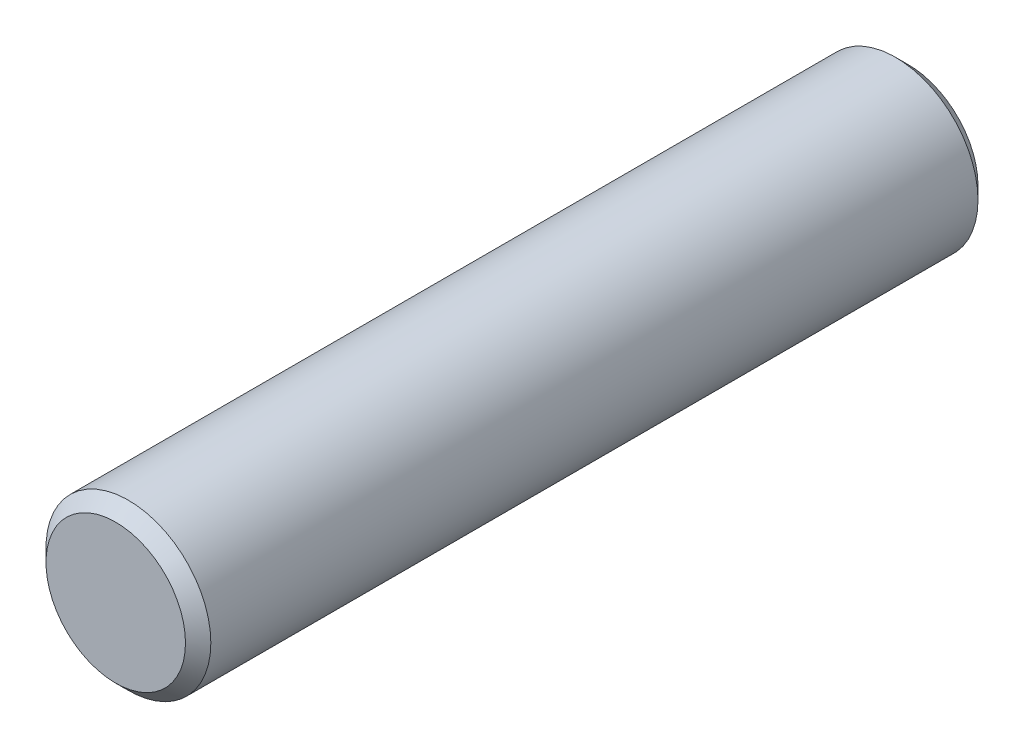
ISO-10303-21;
HEADER;
FILE_DESCRIPTION(('STEP AP214'),'2;1');
FILE_NAME('part.step','',(''),(''),'','','');
FILE_SCHEMA(('AUTOMOTIVE_DESIGN { 1 0 10303 214 1 1 1 1 }'));
ENDSEC;
DATA;
#1=APPLICATION_CONTEXT('core data for automotive mechanical design processes');
#2=APPLICATION_PROTOCOL_DEFINITION('international standard','automotive_design',2000,#1);
#3=PRODUCT_CONTEXT('',#1,'mechanical');
#4=PRODUCT('Part','Part','',(#3));
#5=PRODUCT_RELATED_PRODUCT_CATEGORY('part','',(#4));
#6=PRODUCT_DEFINITION_FORMATION('','',#4);
#7=PRODUCT_DEFINITION_CONTEXT('part definition',#1,'design');
#8=PRODUCT_DEFINITION('design','',#6,#7);
#9=PRODUCT_DEFINITION_SHAPE('','',#8);
#10=(LENGTH_UNIT() NAMED_UNIT(*) SI_UNIT(.MILLI.,.METRE.));
#11=(NAMED_UNIT(*) PLANE_ANGLE_UNIT() SI_UNIT($,.RADIAN.));
#12=(NAMED_UNIT(*) SI_UNIT($,.STERADIAN.) SOLID_ANGLE_UNIT());
#13=UNCERTAINTY_MEASURE_WITH_UNIT(LENGTH_MEASURE(1.E-05),#10,'distance_accuracy_value','');
#14=(GEOMETRIC_REPRESENTATION_CONTEXT(3) GLOBAL_UNCERTAINTY_ASSIGNED_CONTEXT((#13)) GLOBAL_UNIT_ASSIGNED_CONTEXT((#10,
#11,#12)) REPRESENTATION_CONTEXT('',''));
#15=CARTESIAN_POINT('',(0.,0.,0.));
#16=DIRECTION('',(0.,0.,1.));
#17=DIRECTION('',(1.,0.,0.));
#18=AXIS2_PLACEMENT_3D('',#15,#16,#17);
#19=CARTESIAN_POINT('',(0.,0.,-15.875));
#20=DIRECTION('',(0.,0.,1.));
#21=DIRECTION('',(1.,0.,0.));
#22=AXIS2_PLACEMENT_3D('',#19,#20,#21);
#23=CYLINDRICAL_SURFACE('',#22,1.651);
#24=CARTESIAN_POINT('',(0.,0.,-0.254000000000001));
#25=DIRECTION('',(0.,0.,1.));
#26=DIRECTION('',(1.,0.,0.));
#27=AXIS2_PLACEMENT_3D('',#24,#25,#26);
#28=CIRCLE('',#27,1.651);
#29=CARTESIAN_POINT('',(1.651,0.,-0.254000000000001));
#30=VERTEX_POINT('',#29);
#31=EDGE_CURVE('E48',#30,#30,#28,.F.);
#32=ORIENTED_EDGE('',*,*,#31,.T.);
#33=EDGE_LOOP('',(#32));
#34=FACE_BOUND('',#33,.T.);
#35=CARTESIAN_POINT('',(0.,0.,-15.621));
#36=DIRECTION('',(0.,0.,1.));
#37=DIRECTION('',(1.,0.,0.));
#38=AXIS2_PLACEMENT_3D('',#35,#36,#37);
#39=CIRCLE('',#38,1.651);
#40=CARTESIAN_POINT('',(1.651,0.,-15.621));
#41=VERTEX_POINT('',#40);
#42=EDGE_CURVE('E53',#41,#41,#39,.T.);
#43=ORIENTED_EDGE('',*,*,#42,.T.);
#44=EDGE_LOOP('',(#43));
#45=FACE_BOUND('',#44,.T.);
#46=ADVANCED_FACE('F39',(#34,#45),#23,.T.);
#47=CARTESIAN_POINT('',(0.,0.,-15.875));
#48=DIRECTION('',(0.,0.,1.));
#49=DIRECTION('',(1.,0.,0.));
#50=AXIS2_PLACEMENT_3D('',#47,#48,#49);
#51=PLANE('',#50);
#52=CARTESIAN_POINT('',(0.,0.,-15.875));
#53=DIRECTION('',(0.,0.,1.));
#54=DIRECTION('',(1.,0.,0.));
#55=AXIS2_PLACEMENT_3D('',#52,#53,#54);
#56=CIRCLE('',#55,1.397);
#57=CARTESIAN_POINT('',(1.397,0.,-15.875));
#58=VERTEX_POINT('',#57);
#59=EDGE_CURVE('E10',#58,#58,#56,.F.);
#60=ORIENTED_EDGE('',*,*,#59,.T.);
#61=EDGE_LOOP('',(#60));
#62=FACE_BOUND('',#61,.T.);
#63=ADVANCED_FACE('F75',(#62),#51,.F.);
#64=CARTESIAN_POINT('',(0.,0.,0.));
#65=DIRECTION('',(0.,0.,1.));
#66=DIRECTION('',(1.,0.,0.));
#67=AXIS2_PLACEMENT_3D('',#64,#65,#66);
#68=PLANE('',#67);
#69=CARTESIAN_POINT('',(0.,0.,0.));
#70=DIRECTION('',(0.,0.,1.));
#71=DIRECTION('',(1.,0.,0.));
#72=AXIS2_PLACEMENT_3D('',#69,#70,#71);
#73=CIRCLE('',#72,1.397);
#74=CARTESIAN_POINT('',(1.397,0.,0.));
#75=VERTEX_POINT('',#74);
#76=EDGE_CURVE('E58',#75,#75,#73,.T.);
#77=ORIENTED_EDGE('',*,*,#76,.T.);
#78=EDGE_LOOP('',(#77));
#79=FACE_BOUND('',#78,.T.);
#80=ADVANCED_FACE('F65',(#79),#68,.T.);
#81=CARTESIAN_POINT('',(0.,0.,0.));
#82=DIRECTION('',(0.,0.,-1.));
#83=DIRECTION('',(-1.,0.,0.));
#84=AXIS2_PLACEMENT_3D('',#81,#82,#83);
#85=CONICAL_SURFACE('',#84,1.397,0.785398163397449);
#86=ORIENTED_EDGE('',*,*,#31,.F.);
#87=EDGE_LOOP('',(#86));
#88=FACE_BOUND('',#87,.T.);
#89=ORIENTED_EDGE('',*,*,#76,.F.);
#90=EDGE_LOOP('',(#89));
#91=FACE_BOUND('',#90,.T.);
#92=ADVANCED_FACE('F67',(#88,#91),#85,.T.);
#93=CARTESIAN_POINT('',(0.,0.,-15.621));
#94=DIRECTION('',(0.,0.,1.));
#95=DIRECTION('',(1.,0.,0.));
#96=AXIS2_PLACEMENT_3D('',#93,#94,#95);
#97=CONICAL_SURFACE('',#96,1.651,0.785398163397455);
#98=ORIENTED_EDGE('',*,*,#59,.F.);
#99=EDGE_LOOP('',(#98));
#100=FACE_BOUND('',#99,.T.);
#101=ORIENTED_EDGE('',*,*,#42,.F.);
#102=EDGE_LOOP('',(#101));
#103=FACE_BOUND('',#102,.T.);
#104=ADVANCED_FACE('F42',(#100,#103),#97,.T.);
#105=CLOSED_SHELL('',(#46,#63,#80,#92,#104));
#106=MANIFOLD_SOLID_BREP('B2',#105);
#107=ADVANCED_BREP_SHAPE_REPRESENTATION('',(#18,#106),#14);
#108=SHAPE_DEFINITION_REPRESENTATION(#9,#107);
ENDSEC;
END-ISO-10303-21;
